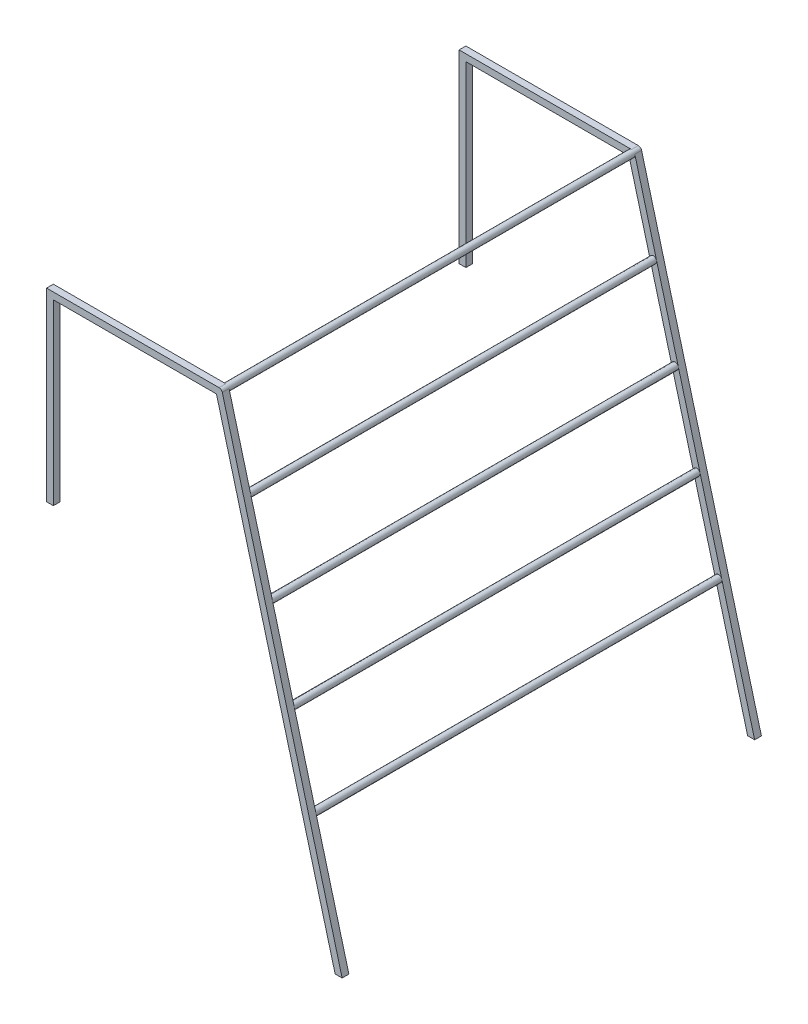
ISO-10303-21;
HEADER;
FILE_DESCRIPTION(('STEP AP214'),'2;1');
FILE_NAME('part.step','',(''),(''),'','','');
FILE_SCHEMA(('AUTOMOTIVE_DESIGN { 1 0 10303 214 1 1 1 1 }'));
ENDSEC;
DATA;
#1=APPLICATION_CONTEXT('core data for automotive mechanical design processes');
#2=APPLICATION_PROTOCOL_DEFINITION('international standard','automotive_design',2000,#1);
#3=PRODUCT_CONTEXT('',#1,'mechanical');
#4=PRODUCT('Part','Part','',(#3));
#5=PRODUCT_RELATED_PRODUCT_CATEGORY('part','',(#4));
#6=PRODUCT_DEFINITION_FORMATION('','',#4);
#7=PRODUCT_DEFINITION_CONTEXT('part definition',#1,'design');
#8=PRODUCT_DEFINITION('design','',#6,#7);
#9=PRODUCT_DEFINITION_SHAPE('','',#8);
#10=(LENGTH_UNIT() NAMED_UNIT(*) SI_UNIT(.MILLI.,.METRE.));
#11=(NAMED_UNIT(*) PLANE_ANGLE_UNIT() SI_UNIT($,.RADIAN.));
#12=(NAMED_UNIT(*) SI_UNIT($,.STERADIAN.) SOLID_ANGLE_UNIT());
#13=UNCERTAINTY_MEASURE_WITH_UNIT(LENGTH_MEASURE(1.E-05),#10,'distance_accuracy_value','');
#14=(GEOMETRIC_REPRESENTATION_CONTEXT(3) GLOBAL_UNCERTAINTY_ASSIGNED_CONTEXT((#13)) GLOBAL_UNIT_ASSIGNED_CONTEXT((#10,
#11,#12)) REPRESENTATION_CONTEXT('',''));
#15=CARTESIAN_POINT('',(0.,0.,0.));
#16=DIRECTION('',(0.,0.,1.));
#17=DIRECTION('',(1.,0.,0.));
#18=AXIS2_PLACEMENT_3D('',#15,#16,#17);
#19=CARTESIAN_POINT('',(352.083655412025,2133.6,50.8));
#20=DIRECTION('',(0.,0.,1.));
#21=DIRECTION('',(1.,0.,0.));
#22=AXIS2_PLACEMENT_3D('',#19,#20,#21);
#23=CYLINDRICAL_SURFACE('',#22,25.4);
#24=CARTESIAN_POINT('',(352.083655412025,2133.6,50.8));
#25=DIRECTION('',(0.,0.,1.));
#26=DIRECTION('',(1.,0.,0.));
#27=AXIS2_PLACEMENT_3D('',#24,#25,#26);
#28=CIRCLE('',#27,25.4);
#29=CARTESIAN_POINT('',(376.618171399767,2140.1740037456,50.8));
#30=VERTEX_POINT('',#29);
#31=CARTESIAN_POINT('',(327.549139424282,2127.0259962544,50.8));
#32=VERTEX_POINT('',#31);
#33=EDGE_CURVE('E272',#30,#32,#28,.F.);
#34=ORIENTED_EDGE('',*,*,#33,.F.);
#35=CARTESIAN_POINT('',(352.083655412025,2133.6,50.8));
#36=DIRECTION('',(0.,0.,1.));
#37=DIRECTION('',(1.,0.,0.));
#38=AXIS2_PLACEMENT_3D('',#35,#36,#37);
#39=CIRCLE('',#38,25.4);
#40=EDGE_CURVE('E487',#32,#30,#39,.F.);
#41=ORIENTED_EDGE('',*,*,#40,.F.);
#42=EDGE_LOOP('',(#34,#41));
#43=FACE_BOUND('',#42,.T.);
#44=CARTESIAN_POINT('',(352.083655412025,2133.6,3098.8));
#45=DIRECTION('',(0.,0.,1.));
#46=DIRECTION('',(1.,0.,0.));
#47=AXIS2_PLACEMENT_3D('',#44,#45,#46);
#48=CIRCLE('',#47,25.4);
#49=CARTESIAN_POINT('',(376.618171399767,2140.1740037456,3098.8));
#50=VERTEX_POINT('',#49);
#51=CARTESIAN_POINT('',(327.549139424282,2127.0259962544,3098.8));
#52=VERTEX_POINT('',#51);
#53=EDGE_CURVE('E370',#50,#52,#48,.F.);
#54=ORIENTED_EDGE('',*,*,#53,.T.);
#55=CARTESIAN_POINT('',(352.083655412025,2133.6,3098.8));
#56=DIRECTION('',(0.,0.,1.));
#57=DIRECTION('',(1.,0.,0.));
#58=AXIS2_PLACEMENT_3D('',#55,#56,#57);
#59=CIRCLE('',#58,25.4);
#60=EDGE_CURVE('E369',#52,#50,#59,.F.);
#61=ORIENTED_EDGE('',*,*,#60,.T.);
#62=EDGE_LOOP('',(#54,#61));
#63=FACE_BOUND('',#62,.T.);
#64=ADVANCED_FACE('F17',(#43,#63),#23,.T.);
#65=CARTESIAN_POINT('',(515.425483118039,1524.,50.8));
#66=DIRECTION('',(0.,0.,1.));
#67=DIRECTION('',(1.,0.,0.));
#68=AXIS2_PLACEMENT_3D('',#65,#66,#67);
#69=CYLINDRICAL_SURFACE('',#68,25.3999999999999);
#70=CARTESIAN_POINT('',(515.425483118039,1524.,50.8));
#71=DIRECTION('',(0.,0.,1.));
#72=DIRECTION('',(1.,0.,0.));
#73=AXIS2_PLACEMENT_3D('',#70,#71,#72);
#74=CIRCLE('',#73,25.3999999999999);
#75=CARTESIAN_POINT('',(539.95999910578,1530.5740037456,50.8));
#76=VERTEX_POINT('',#75);
#77=CARTESIAN_POINT('',(490.890967130296,1517.4259962544,50.8));
#78=VERTEX_POINT('',#77);
#79=EDGE_CURVE('E263',#76,#78,#74,.F.);
#80=ORIENTED_EDGE('',*,*,#79,.F.);
#81=CARTESIAN_POINT('',(515.425483118039,1524.,50.8));
#82=DIRECTION('',(0.,0.,1.));
#83=DIRECTION('',(1.,0.,0.));
#84=AXIS2_PLACEMENT_3D('',#81,#82,#83);
#85=CIRCLE('',#84,25.3999999999999);
#86=EDGE_CURVE('E271',#78,#76,#85,.F.);
#87=ORIENTED_EDGE('',*,*,#86,.F.);
#88=EDGE_LOOP('',(#80,#87));
#89=FACE_BOUND('',#88,.T.);
#90=CARTESIAN_POINT('',(515.425483118039,1524.,3098.8));
#91=DIRECTION('',(0.,0.,1.));
#92=DIRECTION('',(1.,0.,0.));
#93=AXIS2_PLACEMENT_3D('',#90,#91,#92);
#94=CIRCLE('',#93,25.3999999999999);
#95=CARTESIAN_POINT('',(539.95999910578,1530.5740037456,3098.8));
#96=VERTEX_POINT('',#95);
#97=CARTESIAN_POINT('',(490.890967130296,1517.4259962544,3098.8));
#98=VERTEX_POINT('',#97);
#99=EDGE_CURVE('E383',#96,#98,#94,.F.);
#100=ORIENTED_EDGE('',*,*,#99,.T.);
#101=CARTESIAN_POINT('',(515.425483118039,1524.,3098.8));
#102=DIRECTION('',(0.,0.,1.));
#103=DIRECTION('',(1.,0.,0.));
#104=AXIS2_PLACEMENT_3D('',#101,#102,#103);
#105=CIRCLE('',#104,25.3999999999999);
#106=EDGE_CURVE('E377',#98,#96,#105,.F.);
#107=ORIENTED_EDGE('',*,*,#106,.T.);
#108=EDGE_LOOP('',(#100,#107));
#109=FACE_BOUND('',#108,.T.);
#110=ADVANCED_FACE('F650',(#89,#109),#69,.T.);
#111=CARTESIAN_POINT('',(678.76731082405,914.4,50.8));
#112=DIRECTION('',(0.,0.,1.));
#113=DIRECTION('',(1.,0.,0.));
#114=AXIS2_PLACEMENT_3D('',#111,#112,#113);
#115=CYLINDRICAL_SURFACE('',#114,25.3999999999999);
#116=CARTESIAN_POINT('',(678.76731082405,914.4,50.8));
#117=DIRECTION('',(0.,0.,1.));
#118=DIRECTION('',(1.,0.,0.));
#119=AXIS2_PLACEMENT_3D('',#116,#117,#118);
#120=CIRCLE('',#119,25.3999999999999);
#121=CARTESIAN_POINT('',(703.301826811792,920.974003745604,50.8));
#122=VERTEX_POINT('',#121);
#123=CARTESIAN_POINT('',(654.232794836307,907.825996254396,50.8));
#124=VERTEX_POINT('',#123);
#125=EDGE_CURVE('E262',#122,#124,#120,.F.);
#126=ORIENTED_EDGE('',*,*,#125,.F.);
#127=CARTESIAN_POINT('',(678.76731082405,914.4,50.8));
#128=DIRECTION('',(0.,0.,1.));
#129=DIRECTION('',(1.,0.,0.));
#130=AXIS2_PLACEMENT_3D('',#127,#128,#129);
#131=CIRCLE('',#130,25.3999999999999);
#132=EDGE_CURVE('E478',#124,#122,#131,.F.);
#133=ORIENTED_EDGE('',*,*,#132,.F.);
#134=EDGE_LOOP('',(#126,#133));
#135=FACE_BOUND('',#134,.T.);
#136=CARTESIAN_POINT('',(678.76731082405,914.4,3098.8));
#137=DIRECTION('',(0.,0.,1.));
#138=DIRECTION('',(1.,0.,0.));
#139=AXIS2_PLACEMENT_3D('',#136,#137,#138);
#140=CIRCLE('',#139,25.3999999999999);
#141=CARTESIAN_POINT('',(703.301826811792,920.974003745604,3098.8));
#142=VERTEX_POINT('',#141);
#143=CARTESIAN_POINT('',(654.232794836307,907.825996254396,3098.8));
#144=VERTEX_POINT('',#143);
#145=EDGE_CURVE('E20',#142,#144,#140,.F.);
#146=ORIENTED_EDGE('',*,*,#145,.T.);
#147=CARTESIAN_POINT('',(678.76731082405,914.4,3098.8));
#148=DIRECTION('',(0.,0.,1.));
#149=DIRECTION('',(1.,0.,0.));
#150=AXIS2_PLACEMENT_3D('',#147,#148,#149);
#151=CIRCLE('',#150,25.3999999999999);
#152=EDGE_CURVE('E113',#144,#142,#151,.F.);
#153=ORIENTED_EDGE('',*,*,#152,.T.);
#154=EDGE_LOOP('',(#146,#153));
#155=FACE_BOUND('',#154,.T.);
#156=ADVANCED_FACE('F498',(#135,#155),#115,.T.);
#157=CARTESIAN_POINT('',(-1270.,3378.2,3098.8));
#158=DIRECTION('',(-1.,0.,0.));
#159=DIRECTION('',(0.,0.,1.));
#160=AXIS2_PLACEMENT_3D('',#157,#158,#159);
#161=PLANE('',#160);
#162=DIRECTION('',(0.,1.,0.));
#163=VECTOR('',#162,1.);
#164=CARTESIAN_POINT('',(-1270.,2235.57030607951,3149.6));
#165=LINE('',#164,#163);
#166=CARTESIAN_POINT('',(-1270.,3378.2,3149.6));
#167=VERTEX_POINT('',#166);
#168=CARTESIAN_POINT('',(-1270.,1987.55,3149.6));
#169=VERTEX_POINT('',#168);
#170=EDGE_CURVE('E431',#167,#169,#165,.F.);
#171=ORIENTED_EDGE('',*,*,#170,.F.);
#172=DIRECTION('',(0.,0.,1.));
#173=VECTOR('',#172,1.);
#174=CARTESIAN_POINT('',(-1270.,3378.2,3098.8));
#175=LINE('',#174,#173);
#176=CARTESIAN_POINT('',(-1270.,3378.2,3098.8));
#177=VERTEX_POINT('',#176);
#178=EDGE_CURVE('E161',#177,#167,#175,.T.);
#179=ORIENTED_EDGE('',*,*,#178,.F.);
#180=DIRECTION('',(0.,1.,0.));
#181=VECTOR('',#180,1.);
#182=CARTESIAN_POINT('',(-1270.,2235.57030607951,3098.8));
#183=LINE('',#182,#181);
#184=CARTESIAN_POINT('',(-1270.,1987.55,3098.8));
#185=VERTEX_POINT('',#184);
#186=EDGE_CURVE('E333',#177,#185,#183,.F.);
#187=ORIENTED_EDGE('',*,*,#186,.T.);
#188=DIRECTION('',(0.,0.,-1.));
#189=VECTOR('',#188,1.);
#190=CARTESIAN_POINT('',(-1270.,1987.55,3098.8));
#191=LINE('',#190,#189);
#192=EDGE_CURVE('E154',#169,#185,#191,.T.);
#193=ORIENTED_EDGE('',*,*,#192,.F.);
#194=EDGE_LOOP('',(#171,#179,#187,#193));
#195=FACE_BOUND('',#194,.T.);
#196=ADVANCED_FACE('F588',(#195),#161,.T.);
#197=CARTESIAN_POINT('',(-1270.,1987.55,3098.8));
#198=DIRECTION('',(0.,-1.,0.));
#199=DIRECTION('',(0.,0.,-1.));
#200=AXIS2_PLACEMENT_3D('',#197,#198,#199);
#201=PLANE('',#200);
#202=DIRECTION('',(1.,0.,0.));
#203=VECTOR('',#202,1.);
#204=CARTESIAN_POINT('',(-135.563445531409,1987.55,3149.6));
#205=LINE('',#204,#203);
#206=CARTESIAN_POINT('',(-1219.2,1987.55,3149.6));
#207=VERTEX_POINT('',#206);
#208=EDGE_CURVE('E422',#169,#207,#205,.T.);
#209=ORIENTED_EDGE('',*,*,#208,.F.);
#210=ORIENTED_EDGE('',*,*,#192,.T.);
#211=DIRECTION('',(1.,0.,0.));
#212=VECTOR('',#211,1.);
#213=CARTESIAN_POINT('',(-135.563445531409,1987.55,3098.8));
#214=LINE('',#213,#212);
#215=CARTESIAN_POINT('',(-1219.2,1987.55,3098.8));
#216=VERTEX_POINT('',#215);
#217=EDGE_CURVE('E447',#185,#216,#214,.T.);
#218=ORIENTED_EDGE('',*,*,#217,.T.);
#219=DIRECTION('',(0.,0.,-1.));
#220=VECTOR('',#219,1.);
#221=CARTESIAN_POINT('',(-1219.2,1987.55,3098.8));
#222=LINE('',#221,#220);
#223=EDGE_CURVE('E417',#207,#216,#222,.T.);
#224=ORIENTED_EDGE('',*,*,#223,.F.);
#225=EDGE_LOOP('',(#209,#210,#218,#224));
#226=FACE_BOUND('',#225,.T.);
#227=ADVANCED_FACE('F661',(#226),#201,.T.);
#228=CARTESIAN_POINT('',(-1219.2,1987.55,3098.8));
#229=DIRECTION('',(1.,0.,0.));
#230=DIRECTION('',(0.,0.,-1.));
#231=AXIS2_PLACEMENT_3D('',#228,#229,#230);
#232=PLANE('',#231);
#233=DIRECTION('',(0.,1.,0.));
#234=VECTOR('',#233,1.);
#235=CARTESIAN_POINT('',(-1219.2,2235.57030607951,3149.6));
#236=LINE('',#235,#234);
#237=CARTESIAN_POINT('',(-1219.2,3327.4,3149.6));
#238=VERTEX_POINT('',#237);
#239=EDGE_CURVE('E412',#207,#238,#236,.T.);
#240=ORIENTED_EDGE('',*,*,#239,.F.);
#241=ORIENTED_EDGE('',*,*,#223,.T.);
#242=DIRECTION('',(0.,1.,0.));
#243=VECTOR('',#242,1.);
#244=CARTESIAN_POINT('',(-1219.2,2235.57030607951,3098.8));
#245=LINE('',#244,#243);
#246=CARTESIAN_POINT('',(-1219.2,3327.4,3098.8));
#247=VERTEX_POINT('',#246);
#248=EDGE_CURVE('E453',#216,#247,#245,.T.);
#249=ORIENTED_EDGE('',*,*,#248,.T.);
#250=DIRECTION('',(0.,0.,1.));
#251=VECTOR('',#250,1.);
#252=CARTESIAN_POINT('',(-1219.2,3327.4,3098.8));
#253=LINE('',#252,#251);
#254=EDGE_CURVE('E407',#238,#247,#253,.F.);
#255=ORIENTED_EDGE('',*,*,#254,.F.);
#256=EDGE_LOOP('',(#240,#241,#249,#255));
#257=FACE_BOUND('',#256,.T.);
#258=ADVANCED_FACE('F664',(#257),#232,.T.);
#259=CARTESIAN_POINT('',(-1219.2,3327.4,3098.8));
#260=DIRECTION('',(0.,-1.,0.));
#261=DIRECTION('',(1.,0.,0.));
#262=AXIS2_PLACEMENT_3D('',#259,#260,#261);
#263=PLANE('',#262);
#264=DIRECTION('',(1.,0.,0.));
#265=VECTOR('',#264,1.);
#266=CARTESIAN_POINT('',(-135.563445531409,3327.4,3149.6));
#267=LINE('',#266,#265);
#268=CARTESIAN_POINT('',(5.90989450533216,3327.4,3149.6));
#269=VERTEX_POINT('',#268);
#270=EDGE_CURVE('E402',#238,#269,#267,.T.);
#271=ORIENTED_EDGE('',*,*,#270,.F.);
#272=ORIENTED_EDGE('',*,*,#254,.T.);
#273=DIRECTION('',(1.,0.,0.));
#274=VECTOR('',#273,1.);
#275=CARTESIAN_POINT('',(-135.563445531409,3327.4,3098.8));
#276=LINE('',#275,#274);
#277=CARTESIAN_POINT('',(5.90989450533214,3327.4,3098.8));
#278=VERTEX_POINT('',#277);
#279=EDGE_CURVE('E450',#247,#278,#276,.T.);
#280=ORIENTED_EDGE('',*,*,#279,.T.);
#281=DIRECTION('',(0.,0.,1.));
#282=VECTOR('',#281,1.);
#283=CARTESIAN_POINT('',(5.90989450533216,3327.4,3098.8));
#284=LINE('',#283,#282);
#285=EDGE_CURVE('E389',#269,#278,#284,.F.);
#286=ORIENTED_EDGE('',*,*,#285,.F.);
#287=EDGE_LOOP('',(#271,#272,#280,#286));
#288=FACE_BOUND('',#287,.T.);
#289=ADVANCED_FACE('F520',(#288),#263,.T.);
#290=CARTESIAN_POINT('',(5.90989450533216,3327.4,3098.8));
#291=DIRECTION('',(-0.965925826289068,-0.258819045102522,0.));
#292=DIRECTION('',(0.258819045102522,-0.965925826289068,0.));
#293=AXIS2_PLACEMENT_3D('',#290,#291,#292);
#294=PLANE('',#293);
#295=DIRECTION('',(0.258819045102522,-0.965925826289068,0.));
#296=VECTOR('',#295,1.);
#297=CARTESIAN_POINT('',(5.90989450533216,3327.4,3149.6));
#298=LINE('',#297,#296);
#299=CARTESIAN_POINT('',(897.484037400654,1.48029736616688E-13,3149.6));
#300=VERTEX_POINT('',#299);
#301=EDGE_CURVE('E353',#269,#300,#298,.T.);
#302=ORIENTED_EDGE('',*,*,#301,.F.);
#303=ORIENTED_EDGE('',*,*,#285,.T.);
#304=DIRECTION('',(0.258819045102517,-0.965925826289069,0.));
#305=VECTOR('',#304,1.);
#306=CARTESIAN_POINT('',(5.90989450533216,3327.4,3098.8));
#307=LINE('',#306,#305);
#308=CARTESIAN_POINT('',(164.20731171827,2736.62599625439,3098.8));
#309=VERTEX_POINT('',#308);
#310=EDGE_CURVE('E452',#278,#309,#307,.T.);
#311=ORIENTED_EDGE('',*,*,#310,.T.);
#312=DIRECTION('',(0.258819045102527,-0.965925826289067,0.));
#313=VECTOR('',#312,1.);
#314=CARTESIAN_POINT('',(164.207311718269,2736.62599625438,3098.8));
#315=LINE('',#314,#313);
#316=EDGE_CURVE('E366',#309,#52,#315,.T.);
#317=ORIENTED_EDGE('',*,*,#316,.T.);
#318=DIRECTION('',(0.258819045102523,-0.965925826289068,0.));
#319=VECTOR('',#318,1.);
#320=CARTESIAN_POINT('',(327.549139424282,2127.0259962544,3098.8));
#321=LINE('',#320,#319);
#322=EDGE_CURVE('E374',#52,#98,#321,.T.);
#323=ORIENTED_EDGE('',*,*,#322,.T.);
#324=DIRECTION('',(0.258819045102519,-0.965925826289069,0.));
#325=VECTOR('',#324,1.);
#326=CARTESIAN_POINT('',(490.890967130296,1517.4259962544,3098.8));
#327=LINE('',#326,#325);
#328=EDGE_CURVE('E380',#98,#144,#327,.T.);
#329=ORIENTED_EDGE('',*,*,#328,.T.);
#330=DIRECTION('',(0.258819045102523,-0.965925826289068,0.));
#331=VECTOR('',#330,1.);
#332=CARTESIAN_POINT('',(654.232794836307,907.825996254397,3098.8));
#333=LINE('',#332,#331);
#334=CARTESIAN_POINT('',(897.484037400654,0.,3098.8));
#335=VERTEX_POINT('',#334);
#336=EDGE_CURVE('E387',#144,#335,#333,.T.);
#337=ORIENTED_EDGE('',*,*,#336,.T.);
#338=DIRECTION('',(0.,0.,-1.));
#339=VECTOR('',#338,1.);
#340=CARTESIAN_POINT('',(897.484037400654,0.,3098.8));
#341=LINE('',#340,#339);
#342=EDGE_CURVE('E315',#300,#335,#341,.T.);
#343=ORIENTED_EDGE('',*,*,#342,.F.);
#344=EDGE_LOOP('',(#302,#303,#311,#317,#323,#329,#337,#343));
#345=FACE_BOUND('',#344,.T.);
#346=ADVANCED_FACE('F506',(#345),#294,.T.);
#347=CARTESIAN_POINT('',(-135.563445531409,2235.57030607951,3098.8));
#348=DIRECTION('',(0.,0.,1.));
#349=DIRECTION('',(1.,0.,0.));
#350=AXIS2_PLACEMENT_3D('',#347,#348,#349);
#351=PLANE('',#350);
#352=DIRECTION('',(-0.258819045102521,0.965925826289068,0.));
#353=VECTOR('',#352,1.);
#354=CARTESIAN_POINT('',(950.076067365485,0.,3098.8));
#355=LINE('',#354,#353);
#356=CARTESIAN_POINT('',(950.076067365485,0.,3098.8));
#357=VERTEX_POINT('',#356);
#358=EDGE_CURVE('E121',#357,#142,#355,.T.);
#359=ORIENTED_EDGE('',*,*,#358,.F.);
#360=DIRECTION('',(1.,0.,0.));
#361=VECTOR('',#360,1.);
#362=CARTESIAN_POINT('',(897.484037400654,0.,3098.8));
#363=LINE('',#362,#361);
#364=EDGE_CURVE('E392',#335,#357,#363,.T.);
#365=ORIENTED_EDGE('',*,*,#364,.F.);
#366=ORIENTED_EDGE('',*,*,#336,.F.);
#367=ORIENTED_EDGE('',*,*,#145,.F.);
#368=EDGE_LOOP('',(#359,#365,#366,#367));
#369=FACE_BOUND('',#368,.T.);
#370=ADVANCED_FACE('F508',(#369),#351,.F.);
#371=CARTESIAN_POINT('',(-135.563445531409,2235.57030607951,3098.8));
#372=DIRECTION('',(0.,0.,1.));
#373=DIRECTION('',(1.,0.,0.));
#374=AXIS2_PLACEMENT_3D('',#371,#372,#373);
#375=PLANE('',#374);
#376=ORIENTED_EDGE('',*,*,#328,.F.);
#377=ORIENTED_EDGE('',*,*,#99,.F.);
#378=DIRECTION('',(-0.258819045102521,0.965925826289068,0.));
#379=VECTOR('',#378,1.);
#380=CARTESIAN_POINT('',(950.076067365485,0.,3098.8));
#381=LINE('',#380,#379);
#382=EDGE_CURVE('E373',#142,#96,#381,.T.);
#383=ORIENTED_EDGE('',*,*,#382,.F.);
#384=ORIENTED_EDGE('',*,*,#152,.F.);
#385=EDGE_LOOP('',(#376,#377,#383,#384));
#386=FACE_BOUND('',#385,.T.);
#387=ADVANCED_FACE('F503',(#386),#375,.F.);
#388=CARTESIAN_POINT('',(-135.563445531409,2235.57030607951,3098.8));
#389=DIRECTION('',(0.,0.,1.));
#390=DIRECTION('',(1.,0.,0.));
#391=AXIS2_PLACEMENT_3D('',#388,#389,#390);
#392=PLANE('',#391);
#393=DIRECTION('',(-0.258819045102521,0.965925826289068,0.));
#394=VECTOR('',#393,1.);
#395=CARTESIAN_POINT('',(950.076067365485,0.,3098.8));
#396=LINE('',#395,#394);
#397=EDGE_CURVE('E365',#96,#50,#396,.T.);
#398=ORIENTED_EDGE('',*,*,#397,.F.);
#399=ORIENTED_EDGE('',*,*,#106,.F.);
#400=ORIENTED_EDGE('',*,*,#322,.F.);
#401=ORIENTED_EDGE('',*,*,#53,.F.);
#402=EDGE_LOOP('',(#398,#399,#400,#401));
#403=FACE_BOUND('',#402,.T.);
#404=ADVANCED_FACE('F677',(#403),#392,.F.);
#405=CARTESIAN_POINT('',(-135.563445531409,2235.57030607951,3098.8));
#406=DIRECTION('',(0.,0.,1.));
#407=DIRECTION('',(1.,0.,0.));
#408=AXIS2_PLACEMENT_3D('',#405,#406,#407);
#409=PLANE('',#408);
#410=ORIENTED_EDGE('',*,*,#316,.F.);
#411=CARTESIAN_POINT('',(188.741827706013,2743.2,3098.8));
#412=DIRECTION('',(0.,0.,1.));
#413=DIRECTION('',(1.,0.,0.));
#414=AXIS2_PLACEMENT_3D('',#411,#412,#413);
#415=CIRCLE('',#414,25.3999999999999);
#416=CARTESIAN_POINT('',(213.276343693756,2749.7740037456,3098.8));
#417=VERTEX_POINT('',#416);
#418=EDGE_CURVE('E284',#417,#309,#415,.F.);
#419=ORIENTED_EDGE('',*,*,#418,.F.);
#420=DIRECTION('',(-0.258819045102521,0.965925826289068,0.));
#421=VECTOR('',#420,1.);
#422=CARTESIAN_POINT('',(950.076067365485,0.,3098.8));
#423=LINE('',#422,#421);
#424=EDGE_CURVE('E361',#50,#417,#423,.T.);
#425=ORIENTED_EDGE('',*,*,#424,.F.);
#426=ORIENTED_EDGE('',*,*,#60,.F.);
#427=EDGE_LOOP('',(#410,#419,#425,#426));
#428=FACE_BOUND('',#427,.T.);
#429=ADVANCED_FACE('F599',(#428),#409,.F.);
#430=CARTESIAN_POINT('',(897.484037400654,0.,3098.8));
#431=DIRECTION('',(0.,-1.,0.));
#432=DIRECTION('',(0.,0.,-1.));
#433=AXIS2_PLACEMENT_3D('',#430,#431,#432);
#434=PLANE('',#433);
#435=DIRECTION('',(1.,0.,0.));
#436=VECTOR('',#435,1.);
#437=CARTESIAN_POINT('',(-135.563445531409,0.,3149.6));
#438=LINE('',#437,#436);
#439=CARTESIAN_POINT('',(950.076067365485,0.,3149.6));
#440=VERTEX_POINT('',#439);
#441=EDGE_CURVE('E350',#300,#440,#438,.T.);
#442=ORIENTED_EDGE('',*,*,#441,.F.);
#443=ORIENTED_EDGE('',*,*,#342,.T.);
#444=ORIENTED_EDGE('',*,*,#364,.T.);
#445=DIRECTION('',(0.,0.,1.));
#446=VECTOR('',#445,1.);
#447=CARTESIAN_POINT('',(950.076067365485,0.,3098.8));
#448=LINE('',#447,#446);
#449=EDGE_CURVE('E329',#440,#357,#448,.F.);
#450=ORIENTED_EDGE('',*,*,#449,.F.);
#451=EDGE_LOOP('',(#442,#443,#444,#450));
#452=FACE_BOUND('',#451,.T.);
#453=ADVANCED_FACE('F512',(#452),#434,.T.);
#454=CARTESIAN_POINT('',(-1270.,3378.2,0.));
#455=DIRECTION('',(-1.,0.,0.));
#456=DIRECTION('',(0.,0.,1.));
#457=AXIS2_PLACEMENT_3D('',#454,#455,#456);
#458=PLANE('',#457);
#459=DIRECTION('',(0.,1.,0.));
#460=VECTOR('',#459,1.);
#461=CARTESIAN_POINT('',(-1270.,2235.57030607951,50.8));
#462=LINE('',#461,#460);
#463=CARTESIAN_POINT('',(-1270.,3378.2,50.8));
#464=VERTEX_POINT('',#463);
#465=CARTESIAN_POINT('',(-1270.,1987.55,50.8));
#466=VERTEX_POINT('',#465);
#467=EDGE_CURVE('E311',#464,#466,#462,.F.);
#468=ORIENTED_EDGE('',*,*,#467,.F.);
#469=DIRECTION('',(0.,0.,1.));
#470=VECTOR('',#469,1.);
#471=CARTESIAN_POINT('',(-1270.,3378.2,0.));
#472=LINE('',#471,#470);
#473=CARTESIAN_POINT('',(-1270.,3378.2,0.));
#474=VERTEX_POINT('',#473);
#475=EDGE_CURVE('E208',#474,#464,#472,.T.);
#476=ORIENTED_EDGE('',*,*,#475,.F.);
#477=DIRECTION('',(0.,1.,0.));
#478=VECTOR('',#477,1.);
#479=CARTESIAN_POINT('',(-1270.,2235.57030607951,0.));
#480=LINE('',#479,#478);
#481=CARTESIAN_POINT('',(-1270.,1987.55,0.));
#482=VERTEX_POINT('',#481);
#483=EDGE_CURVE('E326',#474,#482,#480,.F.);
#484=ORIENTED_EDGE('',*,*,#483,.T.);
#485=DIRECTION('',(0.,0.,-1.));
#486=VECTOR('',#485,1.);
#487=CARTESIAN_POINT('',(-1270.,1987.55,0.));
#488=LINE('',#487,#486);
#489=EDGE_CURVE('E201',#466,#482,#488,.T.);
#490=ORIENTED_EDGE('',*,*,#489,.F.);
#491=EDGE_LOOP('',(#468,#476,#484,#490));
#492=FACE_BOUND('',#491,.T.);
#493=ADVANCED_FACE('F564',(#492),#458,.T.);
#494=CARTESIAN_POINT('',(-1270.,1987.55,0.));
#495=DIRECTION('',(0.,-1.,0.));
#496=DIRECTION('',(0.,0.,-1.));
#497=AXIS2_PLACEMENT_3D('',#494,#495,#496);
#498=PLANE('',#497);
#499=DIRECTION('',(1.,0.,0.));
#500=VECTOR('',#499,1.);
#501=CARTESIAN_POINT('',(-135.563445531409,1987.55,50.8));
#502=LINE('',#501,#500);
#503=CARTESIAN_POINT('',(-1219.2,1987.55,50.8));
#504=VERTEX_POINT('',#503);
#505=EDGE_CURVE('E302',#466,#504,#502,.T.);
#506=ORIENTED_EDGE('',*,*,#505,.F.);
#507=ORIENTED_EDGE('',*,*,#489,.T.);
#508=DIRECTION('',(1.,0.,0.));
#509=VECTOR('',#508,1.);
#510=CARTESIAN_POINT('',(-135.563445531409,1987.55,0.));
#511=LINE('',#510,#509);
#512=CARTESIAN_POINT('',(-1219.2,1987.55,0.));
#513=VERTEX_POINT('',#512);
#514=EDGE_CURVE('E328',#482,#513,#511,.T.);
#515=ORIENTED_EDGE('',*,*,#514,.T.);
#516=DIRECTION('',(0.,0.,1.));
#517=VECTOR('',#516,1.);
#518=CARTESIAN_POINT('',(-1219.2,1987.55,0.));
#519=LINE('',#518,#517);
#520=EDGE_CURVE('E297',#504,#513,#519,.F.);
#521=ORIENTED_EDGE('',*,*,#520,.F.);
#522=EDGE_LOOP('',(#506,#507,#515,#521));
#523=FACE_BOUND('',#522,.T.);
#524=ADVANCED_FACE('F562',(#523),#498,.T.);
#525=CARTESIAN_POINT('',(-1219.2,1987.55,0.));
#526=DIRECTION('',(1.,0.,0.));
#527=DIRECTION('',(0.,1.,0.));
#528=AXIS2_PLACEMENT_3D('',#525,#526,#527);
#529=PLANE('',#528);
#530=DIRECTION('',(0.,1.,0.));
#531=VECTOR('',#530,1.);
#532=CARTESIAN_POINT('',(-1219.2,2235.57030607951,50.8));
#533=LINE('',#532,#531);
#534=CARTESIAN_POINT('',(-1219.2,3327.4,50.8));
#535=VERTEX_POINT('',#534);
#536=EDGE_CURVE('E292',#504,#535,#533,.T.);
#537=ORIENTED_EDGE('',*,*,#536,.F.);
#538=ORIENTED_EDGE('',*,*,#520,.T.);
#539=DIRECTION('',(0.,1.,0.));
#540=VECTOR('',#539,1.);
#541=CARTESIAN_POINT('',(-1219.2,2235.57030607951,0.));
#542=LINE('',#541,#540);
#543=CARTESIAN_POINT('',(-1219.2,3327.4,0.));
#544=VERTEX_POINT('',#543);
#545=EDGE_CURVE('E341',#513,#544,#542,.T.);
#546=ORIENTED_EDGE('',*,*,#545,.T.);
#547=DIRECTION('',(0.,0.,1.));
#548=VECTOR('',#547,1.);
#549=CARTESIAN_POINT('',(-1219.2,3327.4,0.));
#550=LINE('',#549,#548);
#551=EDGE_CURVE('E285',#535,#544,#550,.F.);
#552=ORIENTED_EDGE('',*,*,#551,.F.);
#553=EDGE_LOOP('',(#537,#538,#546,#552));
#554=FACE_BOUND('',#553,.T.);
#555=ADVANCED_FACE('F560',(#554),#529,.T.);
#556=CARTESIAN_POINT('',(-1219.2,3327.4,0.));
#557=DIRECTION('',(0.,-1.,0.));
#558=DIRECTION('',(1.,0.,0.));
#559=AXIS2_PLACEMENT_3D('',#556,#557,#558);
#560=PLANE('',#559);
#561=DIRECTION('',(1.,0.,0.));
#562=VECTOR('',#561,1.);
#563=CARTESIAN_POINT('',(-135.563445531409,3327.4,50.8));
#564=LINE('',#563,#562);
#565=CARTESIAN_POINT('',(5.90989450533214,3327.4,50.8));
#566=VERTEX_POINT('',#565);
#567=EDGE_CURVE('E288',#535,#566,#564,.T.);
#568=ORIENTED_EDGE('',*,*,#567,.F.);
#569=ORIENTED_EDGE('',*,*,#551,.T.);
#570=DIRECTION('',(1.,0.,0.));
#571=VECTOR('',#570,1.);
#572=CARTESIAN_POINT('',(-135.563445531409,3327.4,0.));
#573=LINE('',#572,#571);
#574=CARTESIAN_POINT('',(5.90989450533216,3327.4,0.));
#575=VERTEX_POINT('',#574);
#576=EDGE_CURVE('E337',#544,#575,#573,.T.);
#577=ORIENTED_EDGE('',*,*,#576,.T.);
#578=DIRECTION('',(0.,0.,1.));
#579=VECTOR('',#578,1.);
#580=CARTESIAN_POINT('',(5.90989450533216,3327.4,0.));
#581=LINE('',#580,#579);
#582=EDGE_CURVE('E281',#566,#575,#581,.F.);
#583=ORIENTED_EDGE('',*,*,#582,.F.);
#584=EDGE_LOOP('',(#568,#569,#577,#583));
#585=FACE_BOUND('',#584,.T.);
#586=ADVANCED_FACE('F557',(#585),#560,.T.);
#587=CARTESIAN_POINT('',(5.90989450533216,3327.4,0.));
#588=DIRECTION('',(-0.965925826289068,-0.258819045102522,0.));
#589=DIRECTION('',(0.258819045102522,-0.965925826289068,0.));
#590=AXIS2_PLACEMENT_3D('',#587,#588,#589);
#591=PLANE('',#590);
#592=DIRECTION('',(0.258819045102517,-0.965925826289069,0.));
#593=VECTOR('',#592,1.);
#594=CARTESIAN_POINT('',(5.90989450533216,3327.4,50.8));
#595=LINE('',#594,#593);
#596=CARTESIAN_POINT('',(164.20731171827,2736.62599625439,50.8));
#597=VERTEX_POINT('',#596);
#598=EDGE_CURVE('E291',#566,#597,#595,.T.);
#599=ORIENTED_EDGE('',*,*,#598,.F.);
#600=ORIENTED_EDGE('',*,*,#582,.T.);
#601=DIRECTION('',(0.258819045102522,-0.965925826289068,0.));
#602=VECTOR('',#601,1.);
#603=CARTESIAN_POINT('',(5.90989450533216,3327.4,0.));
#604=LINE('',#603,#602);
#605=CARTESIAN_POINT('',(897.484037400654,1.48029736616688E-13,0.));
#606=VERTEX_POINT('',#605);
#607=EDGE_CURVE('E228',#575,#606,#604,.T.);
#608=ORIENTED_EDGE('',*,*,#607,.T.);
#609=DIRECTION('',(0.,0.,1.));
#610=VECTOR('',#609,1.);
#611=CARTESIAN_POINT('',(897.484037400654,0.,0.));
#612=LINE('',#611,#610);
#613=CARTESIAN_POINT('',(897.484037400654,0.,50.8));
#614=VERTEX_POINT('',#613);
#615=EDGE_CURVE('E224',#614,#606,#612,.F.);
#616=ORIENTED_EDGE('',*,*,#615,.F.);
#617=DIRECTION('',(0.258819045102523,-0.965925826289068,0.));
#618=VECTOR('',#617,1.);
#619=CARTESIAN_POINT('',(654.232794836307,907.825996254397,50.8));
#620=LINE('',#619,#618);
#621=EDGE_CURVE('E256',#124,#614,#620,.T.);
#622=ORIENTED_EDGE('',*,*,#621,.F.);
#623=DIRECTION('',(0.258819045102519,-0.965925826289069,0.));
#624=VECTOR('',#623,1.);
#625=CARTESIAN_POINT('',(490.890967130296,1517.4259962544,50.8));
#626=LINE('',#625,#624);
#627=EDGE_CURVE('E259',#78,#124,#626,.T.);
#628=ORIENTED_EDGE('',*,*,#627,.F.);
#629=DIRECTION('',(0.258819045102523,-0.965925826289068,0.));
#630=VECTOR('',#629,1.);
#631=CARTESIAN_POINT('',(327.549139424282,2127.0259962544,50.8));
#632=LINE('',#631,#630);
#633=EDGE_CURVE('E268',#32,#78,#632,.T.);
#634=ORIENTED_EDGE('',*,*,#633,.F.);
#635=DIRECTION('',(0.258819045102527,-0.965925826289067,0.));
#636=VECTOR('',#635,1.);
#637=CARTESIAN_POINT('',(164.207311718269,2736.62599625438,50.8));
#638=LINE('',#637,#636);
#639=EDGE_CURVE('E275',#597,#32,#638,.T.);
#640=ORIENTED_EDGE('',*,*,#639,.F.);
#641=EDGE_LOOP('',(#599,#600,#608,#616,#622,#628,#634,#640));
#642=FACE_BOUND('',#641,.T.);
#643=ADVANCED_FACE('F551',(#642),#591,.T.);
#644=CARTESIAN_POINT('',(188.741827706013,2743.2,50.8));
#645=DIRECTION('',(0.,0.,1.));
#646=DIRECTION('',(1.,0.,0.));
#647=AXIS2_PLACEMENT_3D('',#644,#645,#646);
#648=CYLINDRICAL_SURFACE('',#647,25.3999999999999);
#649=CARTESIAN_POINT('',(188.741827706013,2743.2,50.8));
#650=DIRECTION('',(0.,0.,1.));
#651=DIRECTION('',(1.,0.,0.));
#652=AXIS2_PLACEMENT_3D('',#649,#650,#651);
#653=CIRCLE('',#652,25.3999999999999);
#654=CARTESIAN_POINT('',(213.276343693756,2749.7740037456,50.8));
#655=VERTEX_POINT('',#654);
#656=EDGE_CURVE('E277',#655,#597,#653,.F.);
#657=ORIENTED_EDGE('',*,*,#656,.F.);
#658=CARTESIAN_POINT('',(188.741827706013,2743.2,50.8));
#659=DIRECTION('',(0.,0.,1.));
#660=DIRECTION('',(1.,0.,0.));
#661=AXIS2_PLACEMENT_3D('',#658,#659,#660);
#662=CIRCLE('',#661,25.3999999999999);
#663=EDGE_CURVE('E236',#597,#655,#662,.F.);
#664=ORIENTED_EDGE('',*,*,#663,.F.);
#665=EDGE_LOOP('',(#657,#664));
#666=FACE_BOUND('',#665,.T.);
#667=ORIENTED_EDGE('',*,*,#418,.T.);
#668=CARTESIAN_POINT('',(188.741827706013,2743.2,3098.8));
#669=DIRECTION('',(0.,0.,1.));
#670=DIRECTION('',(1.,0.,0.));
#671=AXIS2_PLACEMENT_3D('',#668,#669,#670);
#672=CIRCLE('',#671,25.3999999999999);
#673=EDGE_CURVE('E471',#309,#417,#672,.F.);
#674=ORIENTED_EDGE('',*,*,#673,.T.);
#675=EDGE_LOOP('',(#667,#674));
#676=FACE_BOUND('',#675,.T.);
#677=ADVANCED_FACE('F601',(#666,#676),#648,.T.);
#678=CARTESIAN_POINT('',(-135.563445531409,2235.57030607951,50.8));
#679=DIRECTION('',(0.,0.,1.));
#680=DIRECTION('',(1.,0.,0.));
#681=AXIS2_PLACEMENT_3D('',#678,#679,#680);
#682=PLANE('',#681);
#683=ORIENTED_EDGE('',*,*,#656,.T.);
#684=ORIENTED_EDGE('',*,*,#639,.T.);
#685=ORIENTED_EDGE('',*,*,#40,.T.);
#686=DIRECTION('',(-0.258819045102521,0.965925826289068,0.));
#687=VECTOR('',#686,1.);
#688=CARTESIAN_POINT('',(950.076067365485,0.,50.8));
#689=LINE('',#688,#687);
#690=EDGE_CURVE('E267',#655,#30,#689,.F.);
#691=ORIENTED_EDGE('',*,*,#690,.F.);
#692=EDGE_LOOP('',(#683,#684,#685,#691));
#693=FACE_BOUND('',#692,.T.);
#694=ADVANCED_FACE('F603',(#693),#682,.T.);
#695=CARTESIAN_POINT('',(-135.563445531409,2235.57030607951,50.8));
#696=DIRECTION('',(0.,0.,1.));
#697=DIRECTION('',(1.,0.,0.));
#698=AXIS2_PLACEMENT_3D('',#695,#696,#697);
#699=PLANE('',#698);
#700=ORIENTED_EDGE('',*,*,#86,.T.);
#701=DIRECTION('',(-0.258819045102521,0.965925826289068,0.));
#702=VECTOR('',#701,1.);
#703=CARTESIAN_POINT('',(950.076067365485,0.,50.8));
#704=LINE('',#703,#702);
#705=EDGE_CURVE('E264',#30,#76,#704,.F.);
#706=ORIENTED_EDGE('',*,*,#705,.F.);
#707=ORIENTED_EDGE('',*,*,#33,.T.);
#708=ORIENTED_EDGE('',*,*,#633,.T.);
#709=EDGE_LOOP('',(#700,#706,#707,#708));
#710=FACE_BOUND('',#709,.T.);
#711=ADVANCED_FACE('F611',(#710),#699,.T.);
#712=CARTESIAN_POINT('',(-135.563445531409,2235.57030607951,50.8));
#713=DIRECTION('',(0.,0.,1.));
#714=DIRECTION('',(1.,0.,0.));
#715=AXIS2_PLACEMENT_3D('',#712,#713,#714);
#716=PLANE('',#715);
#717=ORIENTED_EDGE('',*,*,#79,.T.);
#718=ORIENTED_EDGE('',*,*,#627,.T.);
#719=ORIENTED_EDGE('',*,*,#132,.T.);
#720=DIRECTION('',(-0.258819045102521,0.965925826289068,0.));
#721=VECTOR('',#720,1.);
#722=CARTESIAN_POINT('',(950.076067365485,0.,50.8));
#723=LINE('',#722,#721);
#724=EDGE_CURVE('E247',#76,#122,#723,.F.);
#725=ORIENTED_EDGE('',*,*,#724,.F.);
#726=EDGE_LOOP('',(#717,#718,#719,#725));
#727=FACE_BOUND('',#726,.T.);
#728=ADVANCED_FACE('F543',(#727),#716,.T.);
#729=CARTESIAN_POINT('',(-135.563445531409,2235.57030607951,50.8));
#730=DIRECTION('',(0.,0.,1.));
#731=DIRECTION('',(1.,0.,0.));
#732=AXIS2_PLACEMENT_3D('',#729,#730,#731);
#733=PLANE('',#732);
#734=DIRECTION('',(1.,0.,0.));
#735=VECTOR('',#734,1.);
#736=CARTESIAN_POINT('',(897.484037400654,0.,50.8));
#737=LINE('',#736,#735);
#738=CARTESIAN_POINT('',(950.076067365485,0.,50.8));
#739=VERTEX_POINT('',#738);
#740=EDGE_CURVE('E254',#739,#614,#737,.F.);
#741=ORIENTED_EDGE('',*,*,#740,.F.);
#742=DIRECTION('',(-0.258819045102521,0.965925826289068,0.));
#743=VECTOR('',#742,1.);
#744=CARTESIAN_POINT('',(950.076067365485,0.,50.8));
#745=LINE('',#744,#743);
#746=EDGE_CURVE('E241',#122,#739,#745,.F.);
#747=ORIENTED_EDGE('',*,*,#746,.F.);
#748=ORIENTED_EDGE('',*,*,#125,.T.);
#749=ORIENTED_EDGE('',*,*,#621,.T.);
#750=EDGE_LOOP('',(#741,#747,#748,#749));
#751=FACE_BOUND('',#750,.T.);
#752=ADVANCED_FACE('F547',(#751),#733,.T.);
#753=CARTESIAN_POINT('',(897.484037400654,0.,0.));
#754=DIRECTION('',(0.,-1.,0.));
#755=DIRECTION('',(1.,0.,0.));
#756=AXIS2_PLACEMENT_3D('',#753,#754,#755);
#757=PLANE('',#756);
#758=ORIENTED_EDGE('',*,*,#740,.T.);
#759=ORIENTED_EDGE('',*,*,#615,.T.);
#760=DIRECTION('',(1.,0.,0.));
#761=VECTOR('',#760,1.);
#762=CARTESIAN_POINT('',(-135.563445531409,0.,0.));
#763=LINE('',#762,#761);
#764=CARTESIAN_POINT('',(950.076067365485,0.,0.));
#765=VERTEX_POINT('',#764);
#766=EDGE_CURVE('E216',#606,#765,#763,.T.);
#767=ORIENTED_EDGE('',*,*,#766,.T.);
#768=DIRECTION('',(0.,0.,1.));
#769=VECTOR('',#768,1.);
#770=CARTESIAN_POINT('',(950.076067365485,0.,0.));
#771=LINE('',#770,#769);
#772=EDGE_CURVE('E221',#739,#765,#771,.F.);
#773=ORIENTED_EDGE('',*,*,#772,.F.);
#774=EDGE_LOOP('',(#758,#759,#767,#773));
#775=FACE_BOUND('',#774,.T.);
#776=ADVANCED_FACE('F219',(#775),#757,.T.);
#777=CARTESIAN_POINT('',(-135.563445531409,2235.57030607951,3098.8));
#778=DIRECTION('',(0.,0.,1.));
#779=DIRECTION('',(1.,0.,0.));
#780=AXIS2_PLACEMENT_3D('',#777,#778,#779);
#781=PLANE('',#780);
#782=DIRECTION('',(-0.258819045102521,0.965925826289068,0.));
#783=VECTOR('',#782,1.);
#784=CARTESIAN_POINT('',(950.076067365485,0.,3098.8));
#785=LINE('',#784,#783);
#786=CARTESIAN_POINT('',(49.9345159877404,3359.37400374561,3098.8));
#787=VERTEX_POINT('',#786);
#788=EDGE_CURVE('E364',#417,#787,#785,.T.);
#789=ORIENTED_EDGE('',*,*,#788,.F.);
#790=ORIENTED_EDGE('',*,*,#673,.F.);
#791=ORIENTED_EDGE('',*,*,#310,.F.);
#792=ORIENTED_EDGE('',*,*,#279,.F.);
#793=ORIENTED_EDGE('',*,*,#248,.F.);
#794=ORIENTED_EDGE('',*,*,#217,.F.);
#795=ORIENTED_EDGE('',*,*,#186,.F.);
#796=DIRECTION('',(1.,0.,0.));
#797=VECTOR('',#796,1.);
#798=CARTESIAN_POINT('',(25.4,3378.2,3098.8));
#799=LINE('',#798,#797);
#800=CARTESIAN_POINT('',(25.4,3378.2,3098.8));
#801=VERTEX_POINT('',#800);
#802=EDGE_CURVE('E443',#801,#177,#799,.F.);
#803=ORIENTED_EDGE('',*,*,#802,.F.);
#804=CARTESIAN_POINT('',(25.4,3352.8,3098.8));
#805=DIRECTION('',(0.,0.,1.));
#806=DIRECTION('',(1.,0.,0.));
#807=AXIS2_PLACEMENT_3D('',#804,#805,#806);
#808=CIRCLE('',#807,25.4);
#809=EDGE_CURVE('E242',#787,#801,#808,.F.);
#810=ORIENTED_EDGE('',*,*,#809,.F.);
#811=EDGE_LOOP('',(#789,#790,#791,#792,#793,#794,#795,#803,#810));
#812=FACE_BOUND('',#811,.T.);
#813=ADVANCED_FACE('F525',(#812),#781,.F.);
#814=CARTESIAN_POINT('',(25.4,3378.2,3098.8));
#815=DIRECTION('',(0.,1.,0.));
#816=DIRECTION('',(0.,0.,1.));
#817=AXIS2_PLACEMENT_3D('',#814,#815,#816);
#818=PLANE('',#817);
#819=DIRECTION('',(1.,0.,0.));
#820=VECTOR('',#819,1.);
#821=CARTESIAN_POINT('',(-135.563445531409,3378.2,3149.6));
#822=LINE('',#821,#820);
#823=CARTESIAN_POINT('',(25.4,3378.2,3149.6));
#824=VERTEX_POINT('',#823);
#825=EDGE_CURVE('E439',#824,#167,#822,.F.);
#826=ORIENTED_EDGE('',*,*,#825,.F.);
#827=DIRECTION('',(0.,0.,1.));
#828=VECTOR('',#827,1.);
#829=CARTESIAN_POINT('',(25.4,3378.2,0.));
#830=LINE('',#829,#828);
#831=EDGE_CURVE('E245',#801,#824,#830,.T.);
#832=ORIENTED_EDGE('',*,*,#831,.F.);
#833=ORIENTED_EDGE('',*,*,#802,.T.);
#834=ORIENTED_EDGE('',*,*,#178,.T.);
#835=EDGE_LOOP('',(#826,#832,#833,#834));
#836=FACE_BOUND('',#835,.T.);
#837=ADVANCED_FACE('F587',(#836),#818,.T.);
#838=CARTESIAN_POINT('',(-135.563445531409,2235.57030607951,3149.6));
#839=DIRECTION('',(0.,0.,1.));
#840=DIRECTION('',(1.,0.,0.));
#841=AXIS2_PLACEMENT_3D('',#838,#839,#840);
#842=PLANE('',#841);
#843=ORIENTED_EDGE('',*,*,#441,.T.);
#844=DIRECTION('',(-0.258819045102521,0.965925826289068,0.));
#845=VECTOR('',#844,1.);
#846=CARTESIAN_POINT('',(950.076067365485,0.,3149.6));
#847=LINE('',#846,#845);
#848=CARTESIAN_POINT('',(49.9345159877404,3359.37400374561,3149.6));
#849=VERTEX_POINT('',#848);
#850=EDGE_CURVE('E358',#849,#440,#847,.F.);
#851=ORIENTED_EDGE('',*,*,#850,.F.);
#852=CARTESIAN_POINT('',(25.4,3352.8,3149.6));
#853=DIRECTION('',(0.,0.,1.));
#854=DIRECTION('',(1.,0.,0.));
#855=AXIS2_PLACEMENT_3D('',#852,#853,#854);
#856=CIRCLE('',#855,25.4);
#857=EDGE_CURVE('E467',#824,#849,#856,.F.);
#858=ORIENTED_EDGE('',*,*,#857,.F.);
#859=ORIENTED_EDGE('',*,*,#825,.T.);
#860=ORIENTED_EDGE('',*,*,#170,.T.);
#861=ORIENTED_EDGE('',*,*,#208,.T.);
#862=ORIENTED_EDGE('',*,*,#239,.T.);
#863=ORIENTED_EDGE('',*,*,#270,.T.);
#864=ORIENTED_EDGE('',*,*,#301,.T.);
#865=EDGE_LOOP('',(#843,#851,#858,#859,#860,#861,#862,#863,#864));
#866=FACE_BOUND('',#865,.T.);
#867=ADVANCED_FACE('F517',(#866),#842,.T.);
#868=CARTESIAN_POINT('',(950.076067365485,0.,3098.8));
#869=DIRECTION('',(0.965925826289068,0.258819045102521,0.));
#870=DIRECTION('',(-0.258819045102521,0.965925826289068,0.));
#871=AXIS2_PLACEMENT_3D('',#868,#869,#870);
#872=PLANE('',#871);
#873=ORIENTED_EDGE('',*,*,#850,.T.);
#874=ORIENTED_EDGE('',*,*,#449,.T.);
#875=ORIENTED_EDGE('',*,*,#358,.T.);
#876=ORIENTED_EDGE('',*,*,#382,.T.);
#877=ORIENTED_EDGE('',*,*,#397,.T.);
#878=ORIENTED_EDGE('',*,*,#424,.T.);
#879=ORIENTED_EDGE('',*,*,#788,.T.);
#880=DIRECTION('',(0.,0.,1.));
#881=VECTOR('',#880,1.);
#882=CARTESIAN_POINT('',(49.9345159877393,3359.37400374562,0.));
#883=LINE('',#882,#881);
#884=EDGE_CURVE('E466',#849,#787,#883,.F.);
#885=ORIENTED_EDGE('',*,*,#884,.F.);
#886=EDGE_LOOP('',(#873,#874,#875,#876,#877,#878,#879,#885));
#887=FACE_BOUND('',#886,.T.);
#888=ADVANCED_FACE('F594',(#887),#872,.T.);
#889=CARTESIAN_POINT('',(-135.563445531409,2235.57030607951,0.));
#890=DIRECTION('',(0.,0.,1.));
#891=DIRECTION('',(1.,0.,0.));
#892=AXIS2_PLACEMENT_3D('',#889,#890,#891);
#893=PLANE('',#892);
#894=ORIENTED_EDGE('',*,*,#766,.F.);
#895=ORIENTED_EDGE('',*,*,#607,.F.);
#896=ORIENTED_EDGE('',*,*,#576,.F.);
#897=ORIENTED_EDGE('',*,*,#545,.F.);
#898=ORIENTED_EDGE('',*,*,#514,.F.);
#899=ORIENTED_EDGE('',*,*,#483,.F.);
#900=DIRECTION('',(1.,0.,0.));
#901=VECTOR('',#900,1.);
#902=CARTESIAN_POINT('',(25.4,3378.2,0.));
#903=LINE('',#902,#901);
#904=CARTESIAN_POINT('',(25.4,3378.2,0.));
#905=VERTEX_POINT('',#904);
#906=EDGE_CURVE('E227',#905,#474,#903,.F.);
#907=ORIENTED_EDGE('',*,*,#906,.F.);
#908=CARTESIAN_POINT('',(25.4,3352.8,0.));
#909=DIRECTION('',(0.,0.,1.));
#910=DIRECTION('',(1.,0.,0.));
#911=AXIS2_PLACEMENT_3D('',#908,#909,#910);
#912=CIRCLE('',#911,25.4);
#913=CARTESIAN_POINT('',(49.9345159877404,3359.37400374561,0.));
#914=VERTEX_POINT('',#913);
#915=EDGE_CURVE('E234',#914,#905,#912,.T.);
#916=ORIENTED_EDGE('',*,*,#915,.F.);
#917=DIRECTION('',(-0.258819045102521,0.965925826289068,0.));
#918=VECTOR('',#917,1.);
#919=CARTESIAN_POINT('',(950.076067365485,0.,0.));
#920=LINE('',#919,#918);
#921=EDGE_CURVE('E231',#765,#914,#920,.T.);
#922=ORIENTED_EDGE('',*,*,#921,.F.);
#923=EDGE_LOOP('',(#894,#895,#896,#897,#898,#899,#907,#916,#922));
#924=FACE_BOUND('',#923,.T.);
#925=ADVANCED_FACE('F232',(#924),#893,.F.);
#926=CARTESIAN_POINT('',(25.4,3378.2,0.));
#927=DIRECTION('',(0.,1.,0.));
#928=DIRECTION('',(0.,0.,1.));
#929=AXIS2_PLACEMENT_3D('',#926,#927,#928);
#930=PLANE('',#929);
#931=DIRECTION('',(1.,0.,0.));
#932=VECTOR('',#931,1.);
#933=CARTESIAN_POINT('',(-135.563445531409,3378.2,50.8));
#934=LINE('',#933,#932);
#935=CARTESIAN_POINT('',(25.4,3378.2,50.8));
#936=VERTEX_POINT('',#935);
#937=EDGE_CURVE('E320',#936,#464,#934,.F.);
#938=ORIENTED_EDGE('',*,*,#937,.F.);
#939=DIRECTION('',(0.,0.,1.));
#940=VECTOR('',#939,1.);
#941=CARTESIAN_POINT('',(25.4,3378.2,0.));
#942=LINE('',#941,#940);
#943=EDGE_CURVE('E464',#905,#936,#942,.T.);
#944=ORIENTED_EDGE('',*,*,#943,.F.);
#945=ORIENTED_EDGE('',*,*,#906,.T.);
#946=ORIENTED_EDGE('',*,*,#475,.T.);
#947=EDGE_LOOP('',(#938,#944,#945,#946));
#948=FACE_BOUND('',#947,.T.);
#949=ADVANCED_FACE('F566',(#948),#930,.T.);
#950=CARTESIAN_POINT('',(-135.563445531409,2235.57030607951,50.8));
#951=DIRECTION('',(0.,0.,1.));
#952=DIRECTION('',(1.,0.,0.));
#953=AXIS2_PLACEMENT_3D('',#950,#951,#952);
#954=PLANE('',#953);
#955=ORIENTED_EDGE('',*,*,#663,.T.);
#956=DIRECTION('',(-0.258819045102521,0.965925826289068,0.));
#957=VECTOR('',#956,1.);
#958=CARTESIAN_POINT('',(950.076067365485,0.,50.8));
#959=LINE('',#958,#957);
#960=CARTESIAN_POINT('',(49.9345159877404,3359.37400374561,50.8));
#961=VERTEX_POINT('',#960);
#962=EDGE_CURVE('E35',#961,#655,#959,.F.);
#963=ORIENTED_EDGE('',*,*,#962,.F.);
#964=CARTESIAN_POINT('',(25.4,3352.8,50.8));
#965=DIRECTION('',(0.,0.,1.));
#966=DIRECTION('',(1.,0.,0.));
#967=AXIS2_PLACEMENT_3D('',#964,#965,#966);
#968=CIRCLE('',#967,25.4);
#969=EDGE_CURVE('E26',#936,#961,#968,.T.);
#970=ORIENTED_EDGE('',*,*,#969,.F.);
#971=ORIENTED_EDGE('',*,*,#937,.T.);
#972=ORIENTED_EDGE('',*,*,#467,.T.);
#973=ORIENTED_EDGE('',*,*,#505,.T.);
#974=ORIENTED_EDGE('',*,*,#536,.T.);
#975=ORIENTED_EDGE('',*,*,#567,.T.);
#976=ORIENTED_EDGE('',*,*,#598,.T.);
#977=EDGE_LOOP('',(#955,#963,#970,#971,#972,#973,#974,#975,#976));
#978=FACE_BOUND('',#977,.T.);
#979=ADVANCED_FACE('F621',(#978),#954,.T.);
#980=CARTESIAN_POINT('',(950.076067365485,0.,0.));
#981=DIRECTION('',(0.965925826289068,0.258819045102521,0.));
#982=DIRECTION('',(-0.258819045102521,0.965925826289068,0.));
#983=AXIS2_PLACEMENT_3D('',#980,#981,#982);
#984=PLANE('',#983);
#985=ORIENTED_EDGE('',*,*,#746,.T.);
#986=ORIENTED_EDGE('',*,*,#772,.T.);
#987=ORIENTED_EDGE('',*,*,#921,.T.);
#988=DIRECTION('',(0.,0.,1.));
#989=VECTOR('',#988,1.);
#990=CARTESIAN_POINT('',(49.9345159877393,3359.37400374562,0.));
#991=LINE('',#990,#989);
#992=EDGE_CURVE('E11',#961,#914,#991,.F.);
#993=ORIENTED_EDGE('',*,*,#992,.F.);
#994=ORIENTED_EDGE('',*,*,#962,.T.);
#995=ORIENTED_EDGE('',*,*,#690,.T.);
#996=ORIENTED_EDGE('',*,*,#705,.T.);
#997=ORIENTED_EDGE('',*,*,#724,.T.);
#998=EDGE_LOOP('',(#985,#986,#987,#993,#994,#995,#996,#997));
#999=FACE_BOUND('',#998,.T.);
#1000=ADVANCED_FACE('F238',(#999),#984,.T.);
#1001=CARTESIAN_POINT('',(25.4,3352.8,0.));
#1002=DIRECTION('',(0.,0.,1.));
#1003=DIRECTION('',(1.,0.,0.));
#1004=AXIS2_PLACEMENT_3D('',#1001,#1002,#1003);
#1005=CYLINDRICAL_SURFACE('',#1004,25.4);
#1006=ORIENTED_EDGE('',*,*,#969,.T.);
#1007=ORIENTED_EDGE('',*,*,#992,.T.);
#1008=ORIENTED_EDGE('',*,*,#915,.T.);
#1009=ORIENTED_EDGE('',*,*,#943,.T.);
#1010=EDGE_LOOP('',(#1006,#1007,#1008,#1009));
#1011=FACE_BOUND('',#1010,.T.);
#1012=ORIENTED_EDGE('',*,*,#857,.T.);
#1013=ORIENTED_EDGE('',*,*,#884,.T.);
#1014=ORIENTED_EDGE('',*,*,#809,.T.);
#1015=ORIENTED_EDGE('',*,*,#831,.T.);
#1016=EDGE_LOOP('',(#1012,#1013,#1014,#1015));
#1017=FACE_BOUND('',#1016,.T.);
#1018=ADVANCED_FACE('F592',(#1011,#1017),#1005,.T.);
#1019=CLOSED_SHELL('',(#64,#110,#156,#196,#227,#258,#289,#346,#370,#387,#404,#429,#453,#493,
#524,#555,#586,#643,#677,#694,#711,#728,#752,#776,#813,#837,#867,#888,#925,#949,#979,#1000,#1018));
#1020=MANIFOLD_SOLID_BREP('B1',#1019);
#1021=ADVANCED_BREP_SHAPE_REPRESENTATION('',(#18,#1020),#14);
#1022=SHAPE_DEFINITION_REPRESENTATION(#9,#1021);
ENDSEC;
END-ISO-10303-21;
